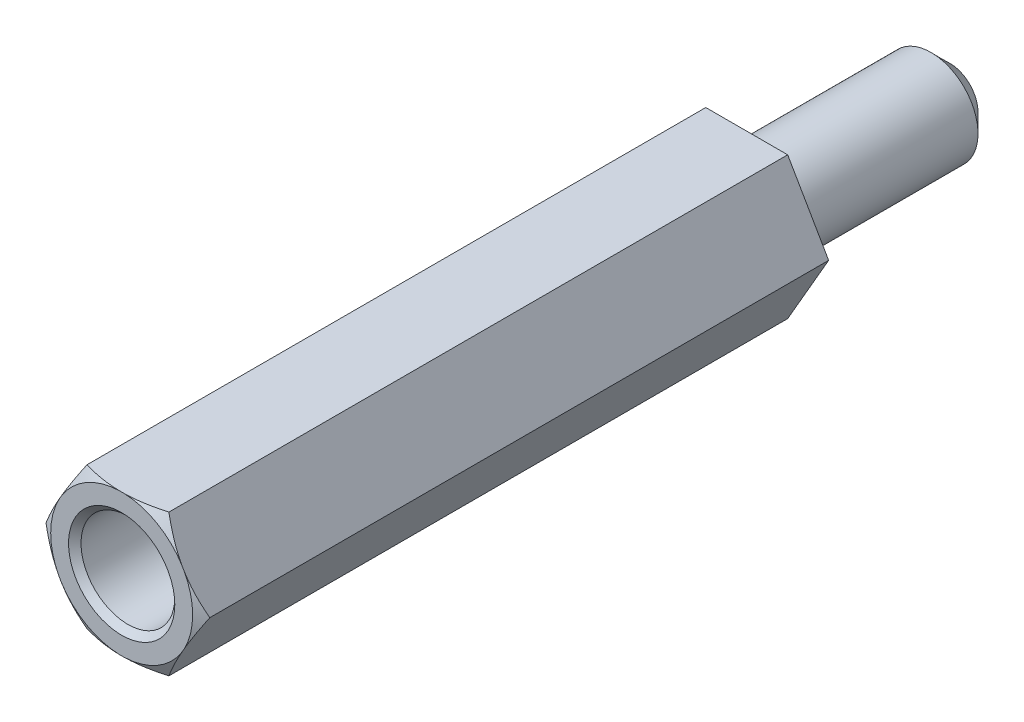
ISO-10303-21;
HEADER;
FILE_DESCRIPTION(('STEP AP214'),'2;1');
FILE_NAME('part.step','',(''),(''),'','','');
FILE_SCHEMA(('AUTOMOTIVE_DESIGN { 1 0 10303 214 1 1 1 1 }'));
ENDSEC;
DATA;
#1=APPLICATION_CONTEXT('core data for automotive mechanical design processes');
#2=APPLICATION_PROTOCOL_DEFINITION('international standard','automotive_design',2000,#1);
#3=PRODUCT_CONTEXT('',#1,'mechanical');
#4=PRODUCT('Part','Part','',(#3));
#5=PRODUCT_RELATED_PRODUCT_CATEGORY('part','',(#4));
#6=PRODUCT_DEFINITION_FORMATION('','',#4);
#7=PRODUCT_DEFINITION_CONTEXT('part definition',#1,'design');
#8=PRODUCT_DEFINITION('design','',#6,#7);
#9=PRODUCT_DEFINITION_SHAPE('','',#8);
#10=(LENGTH_UNIT() NAMED_UNIT(*) SI_UNIT(.MILLI.,.METRE.));
#11=(NAMED_UNIT(*) PLANE_ANGLE_UNIT() SI_UNIT($,.RADIAN.));
#12=(NAMED_UNIT(*) SI_UNIT($,.STERADIAN.) SOLID_ANGLE_UNIT());
#13=UNCERTAINTY_MEASURE_WITH_UNIT(LENGTH_MEASURE(1.E-05),#10,'distance_accuracy_value','');
#14=(GEOMETRIC_REPRESENTATION_CONTEXT(3) GLOBAL_UNCERTAINTY_ASSIGNED_CONTEXT((#13)) GLOBAL_UNIT_ASSIGNED_CONTEXT((#10,
#11,#12)) REPRESENTATION_CONTEXT('',''));
#15=CARTESIAN_POINT('',(0.,0.,0.));
#16=DIRECTION('',(0.,0.,1.));
#17=DIRECTION('',(1.,0.,0.));
#18=AXIS2_PLACEMENT_3D('',#15,#16,#17);
#19=CARTESIAN_POINT('',(0.,0.,20.));
#20=DIRECTION('',(0.,0.,1.));
#21=DIRECTION('',(1.,0.,0.));
#22=AXIS2_PLACEMENT_3D('',#19,#20,#21);
#23=PLANE('',#22);
#24=CARTESIAN_POINT('',(0.,0.,20.));
#25=DIRECTION('',(0.,0.,1.));
#26=DIRECTION('',(1.,0.,0.));
#27=AXIS2_PLACEMENT_3D('',#24,#25,#26);
#28=CIRCLE('',#27,1.7);
#29=CARTESIAN_POINT('',(1.7,0.,20.));
#30=VERTEX_POINT('',#29);
#31=EDGE_CURVE('E161',#30,#30,#28,.F.);
#32=ORIENTED_EDGE('',*,*,#31,.T.);
#33=EDGE_LOOP('',(#32));
#34=FACE_BOUND('',#33,.T.);
#35=CARTESIAN_POINT('',(0.,0.,20.));
#36=DIRECTION('',(0.,0.,1.));
#37=DIRECTION('',(1.,0.,0.));
#38=AXIS2_PLACEMENT_3D('',#35,#36,#37);
#39=CIRCLE('',#38,2.2711702221209);
#40=CARTESIAN_POINT('',(1.92942846272878,-1.19813187298426,20.));
#41=VERTEX_POINT('',#40);
#42=CARTESIAN_POINT('',(0.0728984077241233,-2.27,20.));
#43=VERTEX_POINT('',#42);
#44=EDGE_CURVE('E160',#41,#43,#39,.F.);
#45=ORIENTED_EDGE('',*,*,#44,.F.);
#46=DIRECTION('',(0.499999999999995,0.866025403784442,0.));
#47=VECTOR('',#46,1.);
#48=CARTESIAN_POINT('',(1.31058511106048,-2.26999999999999,20.));
#49=LINE('',#48,#47);
#50=CARTESIAN_POINT('',(2.0023268704526,-1.07186812701572,20.));
#51=VERTEX_POINT('',#50);
#52=EDGE_CURVE('E304',#41,#51,#49,.T.);
#53=ORIENTED_EDGE('',*,*,#52,.T.);
#54=CARTESIAN_POINT('',(2.00232687045273,1.07186812701549,20.));
#55=VERTEX_POINT('',#54);
#56=EDGE_CURVE('E157',#55,#51,#39,.F.);
#57=ORIENTED_EDGE('',*,*,#56,.F.);
#58=DIRECTION('',(-0.500000000000001,0.866025403784438,0.));
#59=VECTOR('',#58,1.);
#60=CARTESIAN_POINT('',(2.6211702221209,0.,20.));
#61=LINE('',#60,#59);
#62=CARTESIAN_POINT('',(1.92942846272862,1.19813187298452,20.));
#63=VERTEX_POINT('',#62);
#64=EDGE_CURVE('E316',#55,#63,#61,.T.);
#65=ORIENTED_EDGE('',*,*,#64,.T.);
#66=CARTESIAN_POINT('',(0.0728984077240917,2.27,20.));
#67=VERTEX_POINT('',#66);
#68=EDGE_CURVE('E159',#67,#63,#39,.F.);
#69=ORIENTED_EDGE('',*,*,#68,.F.);
#70=DIRECTION('',(-1.,0.,0.));
#71=VECTOR('',#70,1.);
#72=CARTESIAN_POINT('',(1.31058511106045,2.27,20.));
#73=LINE('',#72,#71);
#74=CARTESIAN_POINT('',(-0.0728984077241075,2.27,20.));
#75=VERTEX_POINT('',#74);
#76=EDGE_CURVE('E311',#67,#75,#73,.T.);
#77=ORIENTED_EDGE('',*,*,#76,.T.);
#78=CARTESIAN_POINT('',(-1.92942846272863,1.19813187298449,20.));
#79=VERTEX_POINT('',#78);
#80=EDGE_CURVE('E336',#79,#75,#39,.F.);
#81=ORIENTED_EDGE('',*,*,#80,.F.);
#82=DIRECTION('',(-0.499999999999995,-0.866025403784442,0.));
#83=VECTOR('',#82,1.);
#84=CARTESIAN_POINT('',(-1.31058511106046,2.27,20.));
#85=LINE('',#84,#83);
#86=CARTESIAN_POINT('',(-2.00232687045273,1.07186812701548,20.));
#87=VERTEX_POINT('',#86);
#88=EDGE_CURVE('E310',#79,#87,#85,.T.);
#89=ORIENTED_EDGE('',*,*,#88,.T.);
#90=CARTESIAN_POINT('',(-2.00232687045272,-1.0718681270155,20.));
#91=VERTEX_POINT('',#90);
#92=EDGE_CURVE('E121',#91,#87,#39,.F.);
#93=ORIENTED_EDGE('',*,*,#92,.F.);
#94=DIRECTION('',(0.500000000000007,-0.866025403784435,0.));
#95=VECTOR('',#94,1.);
#96=CARTESIAN_POINT('',(-2.6211702221209,0.,20.));
#97=LINE('',#96,#95);
#98=CARTESIAN_POINT('',(-1.92942846272861,-1.19813187298453,20.));
#99=VERTEX_POINT('',#98);
#100=EDGE_CURVE('E137',#91,#99,#97,.T.);
#101=ORIENTED_EDGE('',*,*,#100,.T.);
#102=CARTESIAN_POINT('',(-0.0728984077240759,-2.27,20.));
#103=VERTEX_POINT('',#102);
#104=EDGE_CURVE('E327',#103,#99,#39,.F.);
#105=ORIENTED_EDGE('',*,*,#104,.F.);
#106=DIRECTION('',(1.,0.,0.));
#107=VECTOR('',#106,1.);
#108=CARTESIAN_POINT('',(-1.31058511106043,-2.27000000000001,20.));
#109=LINE('',#108,#107);
#110=EDGE_CURVE('E296',#103,#43,#109,.T.);
#111=ORIENTED_EDGE('',*,*,#110,.T.);
#112=EDGE_LOOP('',(#45,#53,#57,#65,#69,#77,#81,#89,#93,#101,#105,#111));
#113=FACE_BOUND('',#112,.T.);
#114=ADVANCED_FACE('F32',(#34,#113),#23,.T.);
#115=CARTESIAN_POINT('',(1.31058511106048,-2.26999999999999,20.));
#116=DIRECTION('',(-0.866025403784442,0.499999999999995,0.));
#117=DIRECTION('',(-0.499999999999995,-0.866025403784442,0.));
#118=AXIS2_PLACEMENT_3D('',#115,#116,#117);
#119=PLANE('',#118);
#120=DIRECTION('',(0.,0.,-1.));
#121=VECTOR('',#120,1.);
#122=CARTESIAN_POINT('',(2.6211702221209,0.,20.));
#123=LINE('',#122,#121);
#124=CARTESIAN_POINT('',(2.6211702221209,0.,19.8));
#125=VERTEX_POINT('',#124);
#126=CARTESIAN_POINT('',(2.6211702221209,0.,0.));
#127=VERTEX_POINT('',#126);
#128=EDGE_CURVE('E155',#125,#127,#123,.T.);
#129=ORIENTED_EDGE('',*,*,#128,.F.);
#130=CARTESIAN_POINT('',(3.53192502802619,1.5774735970655,19.0874155357182));
#131=CARTESIAN_POINT('',(3.49038683177578,1.50552733070503,19.1258459368283));
#132=CARTESIAN_POINT('',(3.44875020540645,1.43341057837758,19.1638565423729));
#133=CARTESIAN_POINT('',(3.36523806633925,1.28876331046444,19.2388408708484));
#134=CARTESIAN_POINT('',(3.32336252393505,1.21623274342585,19.2758144613019));
#135=CARTESIAN_POINT('',(3.23920416390129,1.07046618796572,19.3486360571844));
#136=CARTESIAN_POINT('',(3.19692046373752,0.997228670950046,19.3844800017565));
#137=CARTESIAN_POINT('',(3.1120387281544,0.850209192285459,19.4546361454567));
#138=CARTESIAN_POINT('',(3.06944070287603,0.776427248201216,19.4889483937519));
#139=CARTESIAN_POINT('',(2.93902958582732,0.550548567601046,19.5907324723442));
#140=CARTESIAN_POINT('',(2.85063034563922,0.39743659224477,19.6552582519314));
#141=CARTESIAN_POINT('',(2.67192637782695,0.0879122404797577,19.7724545253547));
#142=CARTESIAN_POINT('',(2.58162393222902,-0.0684961833435812,19.8251384219436));
#143=CARTESIAN_POINT('',(2.42693241398782,-0.336429752437326,19.8992654299314));
#144=CARTESIAN_POINT('',(2.36310804900721,-0.446976795344554,19.9253337082215));
#145=CARTESIAN_POINT('',(2.23458545503779,-0.669584458020136,19.9666715963234));
#146=CARTESIAN_POINT('',(2.16988756118545,-0.781644497315092,19.9819452339838));
#147=CARTESIAN_POINT('',(2.04077595171336,-1.00527236476775,19.9998836306583));
#148=CARTESIAN_POINT('',(1.9763673113057,-1.11683140240025,20.0026891812466));
#149=CARTESIAN_POINT('',(1.84772217135016,-1.33965132095006,19.9957318097908));
#150=CARTESIAN_POINT('',(1.78348569252724,-1.45091216597068,19.9859674371621));
#151=CARTESIAN_POINT('',(1.63030365883242,-1.71623123113683,19.948841102754));
#152=CARTESIAN_POINT('',(1.54169424329172,-1.86970724088232,19.9160238630181));
#153=CARTESIAN_POINT('',(1.36642171508057,-2.17328816491509,19.8337386865889));
#154=CARTESIAN_POINT('',(1.27976131396272,-2.3233883826555,19.7842489190442));
#155=CARTESIAN_POINT('',(1.10733311832956,-2.62204277814955,19.6734296043506));
#156=CARTESIAN_POINT('',(1.02158612689542,-2.77056092390967,19.6119739052285));
#157=CARTESIAN_POINT('',(0.851622526986614,-3.06494651438903,19.4814839194208));
#158=CARTESIAN_POINT('',(0.767405153907192,-3.21081528344258,19.4124535477671));
#159=CARTESIAN_POINT('',(0.635892107966327,-3.4386025608703,19.2999058489881));
#160=CARTESIAN_POINT('',(0.588222071353258,-3.5211694862828,19.258115008667));
#161=CARTESIAN_POINT('',(0.493605207664278,-3.68505070144494,19.1735241810497));
#162=CARTESIAN_POINT('',(0.446655700740938,-3.76636963282647,19.1307361997354));
#163=CARTESIAN_POINT('',(0.399830305155195,-3.84747359706549,19.0874155357182));
#164=B_SPLINE_CURVE_WITH_KNOTS('',3,(#130,#131,#132,#133,#134,#135,#136,#137,#138,#139,#140,
#141,#142,#143,#144,#145,#146,#147,#148,#149,#150,#151,#152,#153,#154,#155,#156,#157,#158,#159,
#160,#161,#162,#163),.UNSPECIFIED.,.F.,.F.,(4,2,2,2,2,2,2,2,2,2,2,2,2,2,2,2,4),(0.,
0.274606048832124,0.549247019939774,0.82478302101827,1.10031017110168,1.66467514911567,
2.22839812072208,2.61888273310896,3.00922156533179,3.39514124414468,3.7811054625583,
4.32061090335247,4.86082553106862,5.40707820221011,5.9530498563352,6.26533246804885,
6.57488685439786),.UNSPECIFIED.);
#165=EDGE_CURVE('E294',#125,#51,#164,.T.);
#166=ORIENTED_EDGE('',*,*,#165,.T.);
#167=ORIENTED_EDGE('',*,*,#52,.F.);
#168=CARTESIAN_POINT('',(1.31058511106048,-2.26999999999999,19.8));
#169=VERTEX_POINT('',#168);
#170=EDGE_CURVE('E138',#41,#169,#164,.T.);
#171=ORIENTED_EDGE('',*,*,#170,.T.);
#172=DIRECTION('',(0.,0.,-1.));
#173=VECTOR('',#172,1.);
#174=CARTESIAN_POINT('',(1.31058511106048,-2.26999999999999,20.));
#175=LINE('',#174,#173);
#176=CARTESIAN_POINT('',(1.31058511106048,-2.26999999999999,0.));
#177=VERTEX_POINT('',#176);
#178=EDGE_CURVE('E150',#169,#177,#175,.T.);
#179=ORIENTED_EDGE('',*,*,#178,.T.);
#180=DIRECTION('',(0.499999999999995,0.866025403784442,0.));
#181=VECTOR('',#180,1.);
#182=CARTESIAN_POINT('',(1.31058511106048,-2.26999999999999,0.));
#183=LINE('',#182,#181);
#184=EDGE_CURVE('E282',#177,#127,#183,.T.);
#185=ORIENTED_EDGE('',*,*,#184,.T.);
#186=EDGE_LOOP('',(#129,#166,#167,#171,#179,#185));
#187=FACE_BOUND('',#186,.T.);
#188=ADVANCED_FACE('F243',(#187),#119,.F.);
#189=CARTESIAN_POINT('',(2.6211702221209,0.,20.));
#190=DIRECTION('',(-0.866025403784438,-0.500000000000001,0.));
#191=DIRECTION('',(0.500000000000001,-0.866025403784438,0.));
#192=AXIS2_PLACEMENT_3D('',#189,#190,#191);
#193=PLANE('',#192);
#194=DIRECTION('',(0.,0.,-1.));
#195=VECTOR('',#194,1.);
#196=CARTESIAN_POINT('',(1.31058511106045,2.27,20.));
#197=LINE('',#196,#195);
#198=CARTESIAN_POINT('',(1.31058511106045,2.27,19.8));
#199=VERTEX_POINT('',#198);
#200=CARTESIAN_POINT('',(1.31058511106045,2.27,0.));
#201=VERTEX_POINT('',#200);
#202=EDGE_CURVE('E148',#199,#201,#197,.T.);
#203=ORIENTED_EDGE('',*,*,#202,.F.);
#204=CARTESIAN_POINT('',(0.399830305155138,3.84747359706553,19.0874155357182));
#205=CARTESIAN_POINT('',(0.441368501405548,3.77552733070505,19.1258459368283));
#206=CARTESIAN_POINT('',(0.483005127774879,3.70341057837761,19.1638565423728));
#207=CARTESIAN_POINT('',(0.566517266842076,3.55876331046446,19.2388408708484));
#208=CARTESIAN_POINT('',(0.60839280924628,3.48623274342588,19.2758144613019));
#209=CARTESIAN_POINT('',(0.692551169280034,3.34046618796574,19.3486360571844));
#210=CARTESIAN_POINT('',(0.734834869443811,3.26722867095007,19.3844800017565));
#211=CARTESIAN_POINT('',(0.819716605026928,3.12020919228549,19.4546361454567));
#212=CARTESIAN_POINT('',(0.8623146303053,3.04642724820124,19.4889483937519));
#213=CARTESIAN_POINT('',(0.992725747354006,2.82054856760107,19.5907324723442));
#214=CARTESIAN_POINT('',(1.08112498754211,2.6674365922448,19.6552582519314));
#215=CARTESIAN_POINT('',(1.25982895535438,2.35791224047979,19.7724545253547));
#216=CARTESIAN_POINT('',(1.35013140095231,2.20150381665645,19.8251384219436));
#217=CARTESIAN_POINT('',(1.50482291919352,1.93357024756271,19.8992654299313));
#218=CARTESIAN_POINT('',(1.56864728417413,1.82302320465548,19.9253337082215));
#219=CARTESIAN_POINT('',(1.69716987814355,1.6004155419799,19.9666715963234));
#220=CARTESIAN_POINT('',(1.76186777199589,1.48835550268494,19.9819452339838));
#221=CARTESIAN_POINT('',(1.89097938146798,1.26472763523229,19.9998836306583));
#222=CARTESIAN_POINT('',(1.95538802187564,1.15316859759979,20.0026891812466));
#223=CARTESIAN_POINT('',(2.08403316183118,0.930348679049981,19.9957318097908));
#224=CARTESIAN_POINT('',(2.1482696406541,0.81908783402936,19.9859674371621));
#225=CARTESIAN_POINT('',(2.30145167434892,0.553768768863213,19.9488411027541));
#226=CARTESIAN_POINT('',(2.39006108988962,0.400292759117732,19.9160238630181));
#227=CARTESIAN_POINT('',(2.56533361810077,0.0967118350849743,19.8337386865889));
#228=CARTESIAN_POINT('',(2.65199401921862,-0.0533883826554375,19.7842489190442));
#229=CARTESIAN_POINT('',(2.82442221485177,-0.352042778149478,19.6734296043507));
#230=CARTESIAN_POINT('',(2.91016920628591,-0.500560923909593,19.6119739052285));
#231=CARTESIAN_POINT('',(3.08013280619471,-0.794946514388941,19.4814839194209));
#232=CARTESIAN_POINT('',(3.16435017927413,-0.940815283442479,19.4124535477672));
#233=CARTESIAN_POINT('',(3.29586322521501,-1.16860256087022,19.2999058489881));
#234=CARTESIAN_POINT('',(3.34353326182809,-1.25116948628275,19.258115008667));
#235=CARTESIAN_POINT('',(3.4381501255171,-1.41505070144493,19.1735241810497));
#236=CARTESIAN_POINT('',(3.48509963244045,-1.49636963282648,19.1307361997354));
#237=CARTESIAN_POINT('',(3.53192502802621,-1.57747359706552,19.0874155357182));
#238=B_SPLINE_CURVE_WITH_KNOTS('',3,(#204,#205,#206,#207,#208,#209,#210,#211,#212,#213,#214,
#215,#216,#217,#218,#219,#220,#221,#222,#223,#224,#225,#226,#227,#228,#229,#230,#231,#232,#233,
#234,#235,#236,#237),.UNSPECIFIED.,.F.,.F.,(4,2,2,2,2,2,2,2,2,2,2,2,2,2,2,2,4),(0.,
0.274606048832124,0.549247019939776,0.824783021018268,1.10031017110168,1.66467514911567,
2.22839812072209,2.61888273310896,3.00922156533179,3.39514124414468,3.7811054625583,
4.32061090335245,4.86082553106858,5.40707820221006,5.95304985633513,6.26533246804886,
6.57488685439796),.UNSPECIFIED.);
#239=EDGE_CURVE('E228',#199,#63,#238,.T.);
#240=ORIENTED_EDGE('',*,*,#239,.T.);
#241=ORIENTED_EDGE('',*,*,#64,.F.);
#242=EDGE_CURVE('E325',#55,#125,#238,.T.);
#243=ORIENTED_EDGE('',*,*,#242,.T.);
#244=ORIENTED_EDGE('',*,*,#128,.T.);
#245=DIRECTION('',(-0.500000000000001,0.866025403784438,0.));
#246=VECTOR('',#245,1.);
#247=CARTESIAN_POINT('',(2.6211702221209,0.,0.));
#248=LINE('',#247,#246);
#249=EDGE_CURVE('E287',#127,#201,#248,.T.);
#250=ORIENTED_EDGE('',*,*,#249,.T.);
#251=EDGE_LOOP('',(#203,#240,#241,#243,#244,#250));
#252=FACE_BOUND('',#251,.T.);
#253=ADVANCED_FACE('F238',(#252),#193,.F.);
#254=CARTESIAN_POINT('',(1.31058511106045,2.27,20.));
#255=DIRECTION('',(0.,-1.,0.));
#256=DIRECTION('',(1.,0.,0.));
#257=AXIS2_PLACEMENT_3D('',#254,#255,#256);
#258=PLANE('',#257);
#259=DIRECTION('',(0.,0.,-1.));
#260=VECTOR('',#259,1.);
#261=CARTESIAN_POINT('',(-1.31058511106046,2.27,20.));
#262=LINE('',#261,#260);
#263=CARTESIAN_POINT('',(-1.31058511106046,2.27,19.8));
#264=VERTEX_POINT('',#263);
#265=CARTESIAN_POINT('',(-1.31058511106046,2.27,0.));
#266=VERTEX_POINT('',#265);
#267=EDGE_CURVE('E145',#264,#266,#262,.T.);
#268=ORIENTED_EDGE('',*,*,#267,.F.);
#269=CARTESIAN_POINT('',(-2.88805870812598,2.26999999999999,19.1987324103344));
#270=CARTESIAN_POINT('',(-2.80547290408561,2.26999999999999,19.2358255324642));
#271=CARTESIAN_POINT('',(-2.72266390787582,2.26999999999999,19.2724300278098));
#272=CARTESIAN_POINT('',(-2.5565026612848,2.26999999999999,19.3444249566602));
#273=CARTESIAN_POINT('',(-2.47315031505662,2.26999999999999,19.3798151686687));
#274=CARTESIAN_POINT('',(-2.30548338672952,2.26999999999999,19.4492769222981));
#275=CARTESIAN_POINT('',(-2.22116623150815,2.26999999999999,19.4833422884396));
#276=CARTESIAN_POINT('',(-2.05182779905438,2.26999999999999,19.5496595457378));
#277=CARTESIAN_POINT('',(-1.96680655448941,2.26999999999999,19.5819115204949));
#278=CARTESIAN_POINT('',(-1.71138311857312,2.26999999999999,19.6750656041859));
#279=CARTESIAN_POINT('',(-1.53976972748372,2.26999999999999,19.7327268658694));
#280=CARTESIAN_POINT('',(-1.19280228070996,2.27,19.8349421604165));
#281=CARTESIAN_POINT('',(-1.0174542453261,2.27,19.879515794802));
#282=CARTESIAN_POINT('',(-0.712090771389066,2.27,19.9400719954737));
#283=CARTESIAN_POINT('',(-0.582987722953598,2.27,19.9605553386303));
#284=CARTESIAN_POINT('',(-0.323439084569022,2.27,19.989581233522));
#285=CARTESIAN_POINT('',(-0.192993977067311,2.27,19.9981279349084));
#286=CARTESIAN_POINT('',(0.0680599454394179,2.27,20.0022273630874));
#287=CARTESIAN_POINT('',(0.198668678458226,2.27,19.9977850727737));
#288=CARTESIAN_POINT('',(0.458851198221977,2.27,19.976485692699));
#289=CARTESIAN_POINT('',(0.58842474295573,2.27,19.9596257810572));
#290=CARTESIAN_POINT('',(0.904937752962769,2.27,19.9051607953018));
#291=CARTESIAN_POINT('',(1.09083477493526,2.27,19.8615794043185));
#292=CARTESIAN_POINT('',(1.36639728986913,2.27,19.7844964765957));
#293=CARTESIAN_POINT('',(1.457811536611,2.27,19.7568102536344));
#294=CARTESIAN_POINT('',(1.63961899594484,2.27000000000001,19.6982591090532));
#295=CARTESIAN_POINT('',(1.73001229033947,2.27000000000001,19.6673944441364));
#296=CARTESIAN_POINT('',(1.91077257487063,2.27000000000001,19.6027837141474));
#297=CARTESIAN_POINT('',(2.00113026057099,2.27000000000001,19.5690119189924));
#298=CARTESIAN_POINT('',(2.18103313876789,2.27000000000001,19.499360278944));
#299=CARTESIAN_POINT('',(2.27057828364605,2.27000000000001,19.4634803114121));
#300=CARTESIAN_POINT('',(2.44846011178726,2.27000000000001,19.3902269588395));
#301=CARTESIAN_POINT('',(2.53680076536779,2.27000000000001,19.352863166806));
#302=CARTESIAN_POINT('',(2.71286376090329,2.27000000000001,19.2767584059864));
#303=CARTESIAN_POINT('',(2.80058623966965,2.27000000000001,19.2380177541729));
#304=CARTESIAN_POINT('',(2.88805870812597,2.27000000000001,19.1987324103344));
#305=B_SPLINE_CURVE_WITH_KNOTS('',3,(#269,#270,#271,#272,#273,#274,#275,#276,#277,#278,#279,
#280,#281,#282,#283,#284,#285,#286,#287,#288,#289,#290,#291,#292,#293,#294,#295,#296,#297,#298,
#299,#300,#301,#302,#303,#304),.UNSPECIFIED.,.F.,.F.,(4,2,2,2,2,2,2,2,2,2,2,2,2,2,2,2,2,4),(0.,
0.271603728461578,0.543256739373978,0.816052841064966,1.08883635605,1.63163153509611,
2.17360956621754,2.56530041766832,2.95685506788363,3.34825952790367,3.73975296129823,
4.31141566486306,4.59793246001131,4.88442613310071,5.17378506531959,5.46316084709717,
5.75090015934329,6.03857365362723),.UNSPECIFIED.);
#306=EDGE_CURVE('E220',#264,#75,#305,.T.);
#307=ORIENTED_EDGE('',*,*,#306,.T.);
#308=ORIENTED_EDGE('',*,*,#76,.F.);
#309=EDGE_CURVE('E227',#67,#199,#305,.T.);
#310=ORIENTED_EDGE('',*,*,#309,.T.);
#311=ORIENTED_EDGE('',*,*,#202,.T.);
#312=DIRECTION('',(-1.,0.,0.));
#313=VECTOR('',#312,1.);
#314=CARTESIAN_POINT('',(1.31058511106045,2.27,0.));
#315=LINE('',#314,#313);
#316=EDGE_CURVE('E291',#201,#266,#315,.T.);
#317=ORIENTED_EDGE('',*,*,#316,.T.);
#318=EDGE_LOOP('',(#268,#307,#308,#310,#311,#317));
#319=FACE_BOUND('',#318,.T.);
#320=ADVANCED_FACE('F235',(#319),#258,.F.);
#321=CARTESIAN_POINT('',(-1.31058511106046,2.27,20.));
#322=DIRECTION('',(0.866025403784442,-0.499999999999995,0.));
#323=DIRECTION('',(0.499999999999995,0.866025403784442,0.));
#324=AXIS2_PLACEMENT_3D('',#321,#322,#323);
#325=PLANE('',#324);
#326=DIRECTION('',(0.,0.,-1.));
#327=VECTOR('',#326,1.);
#328=CARTESIAN_POINT('',(-2.6211702221209,0.,20.));
#329=LINE('',#328,#327);
#330=CARTESIAN_POINT('',(-2.6211702221209,0.,19.8));
#331=VERTEX_POINT('',#330);
#332=CARTESIAN_POINT('',(-2.6211702221209,0.,0.));
#333=VERTEX_POINT('',#332);
#334=EDGE_CURVE('E133',#331,#333,#329,.T.);
#335=ORIENTED_EDGE('',*,*,#334,.F.);
#336=CARTESIAN_POINT('',(-3.5319250280262,-1.57747359706554,19.0874155357182));
#337=CARTESIAN_POINT('',(-3.49038683177579,-1.50552733070506,19.1258459368283));
#338=CARTESIAN_POINT('',(-3.44875020540646,-1.43341057837762,19.1638565423728));
#339=CARTESIAN_POINT('',(-3.36523806633926,-1.28876331046448,19.2388408708484));
#340=CARTESIAN_POINT('',(-3.32336252393506,-1.21623274342589,19.2758144613019));
#341=CARTESIAN_POINT('',(-3.2392041639013,-1.07046618796575,19.3486360571844));
#342=CARTESIAN_POINT('',(-3.19692046373753,-0.997228670950083,19.3844800017565));
#343=CARTESIAN_POINT('',(-3.11203872815441,-0.850209192285496,19.4546361454567));
#344=CARTESIAN_POINT('',(-3.06944070287604,-0.776427248201252,19.4889483937519));
#345=CARTESIAN_POINT('',(-2.93902958582734,-0.550548567601082,19.5907324723442));
#346=CARTESIAN_POINT('',(-2.85063034563924,-0.397436592244806,19.6552582519314));
#347=CARTESIAN_POINT('',(-2.67192637782696,-0.0879122404797936,19.7724545253547));
#348=CARTESIAN_POINT('',(-2.58162393222904,0.068496183343545,19.8251384219436));
#349=CARTESIAN_POINT('',(-2.42693241398783,0.336429752437289,19.8992654299313));
#350=CARTESIAN_POINT('',(-2.36310804900722,0.446976795344516,19.9253337082215));
#351=CARTESIAN_POINT('',(-2.2345854550378,0.669584458020097,19.9666715963234));
#352=CARTESIAN_POINT('',(-2.16988756118546,0.781644497315053,19.9819452339838));
#353=CARTESIAN_POINT('',(-2.04077595171337,1.00527236476771,19.9998836306583));
#354=CARTESIAN_POINT('',(-1.97636731130571,1.11683140240021,20.0026891812466));
#355=CARTESIAN_POINT('',(-1.84772217135017,1.33965132095002,19.9957318097908));
#356=CARTESIAN_POINT('',(-1.78348569252725,1.45091216597064,19.9859674371621));
#357=CARTESIAN_POINT('',(-1.63030365883244,1.71623123113679,19.948841102754));
#358=CARTESIAN_POINT('',(-1.54169424329174,1.86970724088227,19.9160238630181));
#359=CARTESIAN_POINT('',(-1.36642171508059,2.17328816491503,19.8337386865889));
#360=CARTESIAN_POINT('',(-1.27976131396274,2.32338838265544,19.7842489190442));
#361=CARTESIAN_POINT('',(-1.10733311832959,2.62204277814949,19.6734296043507));
#362=CARTESIAN_POINT('',(-1.02158612689545,2.7705609239096,19.6119739052285));
#363=CARTESIAN_POINT('',(-0.851622526986649,3.06494651438895,19.4814839194208));
#364=CARTESIAN_POINT('',(-0.76740515390723,3.21081528344249,19.4124535477672));
#365=CARTESIAN_POINT('',(-0.635892107966356,3.43860256087023,19.2999058489881));
#366=CARTESIAN_POINT('',(-0.588222071353275,3.52116948628275,19.258115008667));
#367=CARTESIAN_POINT('',(-0.493605207664273,3.68505070144493,19.1735241810497));
#368=CARTESIAN_POINT('',(-0.446655700740922,3.76636963282648,19.1307361997354));
#369=CARTESIAN_POINT('',(-0.399830305155168,3.84747359706552,19.0874155357182));
#370=B_SPLINE_CURVE_WITH_KNOTS('',3,(#336,#337,#338,#339,#340,#341,#342,#343,#344,#345,#346,
#347,#348,#349,#350,#351,#352,#353,#354,#355,#356,#357,#358,#359,#360,#361,#362,#363,#364,#365,
#366,#367,#368,#369),.UNSPECIFIED.,.F.,.F.,(4,2,2,2,2,2,2,2,2,2,2,2,2,2,2,2,4),(0.,
0.274606048832125,0.549247019939774,0.82478302101827,1.10031017110168,1.66467514911567,
2.22839812072209,2.61888273310896,3.00922156533179,3.39514124414468,3.7811054625583,
4.32061090335245,4.86082553106859,5.40707820221007,5.95304985633514,6.26533246804886,
6.57488685439794),.UNSPECIFIED.);
#371=EDGE_CURVE('E119',#331,#87,#370,.T.);
#372=ORIENTED_EDGE('',*,*,#371,.T.);
#373=ORIENTED_EDGE('',*,*,#88,.F.);
#374=EDGE_CURVE('E126',#79,#264,#370,.T.);
#375=ORIENTED_EDGE('',*,*,#374,.T.);
#376=ORIENTED_EDGE('',*,*,#267,.T.);
#377=DIRECTION('',(-0.499999999999995,-0.866025403784442,0.));
#378=VECTOR('',#377,1.);
#379=CARTESIAN_POINT('',(-1.31058511106046,2.27,0.));
#380=LINE('',#379,#378);
#381=EDGE_CURVE('E143',#266,#333,#380,.T.);
#382=ORIENTED_EDGE('',*,*,#381,.T.);
#383=EDGE_LOOP('',(#335,#372,#373,#375,#376,#382));
#384=FACE_BOUND('',#383,.T.);
#385=ADVANCED_FACE('F141',(#384),#325,.F.);
#386=CARTESIAN_POINT('',(-2.6211702221209,0.,20.));
#387=DIRECTION('',(0.866025403784435,0.500000000000007,0.));
#388=DIRECTION('',(-0.500000000000007,0.866025403784435,0.));
#389=AXIS2_PLACEMENT_3D('',#386,#387,#388);
#390=PLANE('',#389);
#391=DIRECTION('',(0.,0.,-1.));
#392=VECTOR('',#391,1.);
#393=CARTESIAN_POINT('',(-1.31058511106043,-2.27000000000001,20.));
#394=LINE('',#393,#392);
#395=CARTESIAN_POINT('',(-1.31058511106043,-2.27000000000001,19.8));
#396=VERTEX_POINT('',#395);
#397=CARTESIAN_POINT('',(-1.31058511106043,-2.27000000000001,0.));
#398=VERTEX_POINT('',#397);
#399=EDGE_CURVE('E146',#396,#398,#394,.T.);
#400=ORIENTED_EDGE('',*,*,#399,.F.);
#401=CARTESIAN_POINT('',(-0.399830305155107,-3.84747359706554,19.0874155357182));
#402=CARTESIAN_POINT('',(-0.441368501405518,-3.77552733070506,19.1258459368283));
#403=CARTESIAN_POINT('',(-0.48300512777485,-3.70341057837762,19.1638565423728));
#404=CARTESIAN_POINT('',(-0.566517266842048,-3.55876331046447,19.2388408708484));
#405=CARTESIAN_POINT('',(-0.608392809246252,-3.48623274342589,19.2758144613019));
#406=CARTESIAN_POINT('',(-0.692551169280007,-3.34046618796575,19.3486360571844));
#407=CARTESIAN_POINT('',(-0.734834869443784,-3.26722867095008,19.3844800017565));
#408=CARTESIAN_POINT('',(-0.819716605026902,-3.1202091922855,19.4546361454567));
#409=CARTESIAN_POINT('',(-0.862314630305275,-3.04642724820126,19.4889483937519));
#410=CARTESIAN_POINT('',(-0.992725747353983,-2.82054856760109,19.5907324723442));
#411=CARTESIAN_POINT('',(-1.08112498754208,-2.66743659224481,19.6552582519314));
#412=CARTESIAN_POINT('',(-1.25982895535436,-2.3579122404798,19.7724545253547));
#413=CARTESIAN_POINT('',(-1.35013140095229,-2.20150381665646,19.8251384219436));
#414=CARTESIAN_POINT('',(-1.5048229191935,-1.93357024756272,19.8992654299313));
#415=CARTESIAN_POINT('',(-1.56864728417411,-1.8230232046555,19.9253337082215));
#416=CARTESIAN_POINT('',(-1.69716987814353,-1.60041554197992,19.9666715963234));
#417=CARTESIAN_POINT('',(-1.76186777199587,-1.48835550268496,19.9819452339838));
#418=CARTESIAN_POINT('',(-1.89097938146797,-1.26472763523231,19.9998836306583));
#419=CARTESIAN_POINT('',(-1.95538802187563,-1.15316859759981,20.0026891812466));
#420=CARTESIAN_POINT('',(-2.08403316183117,-0.930348679050002,19.9957318097908));
#421=CARTESIAN_POINT('',(-2.14826964065409,-0.819087834029382,19.9859674371621));
#422=CARTESIAN_POINT('',(-2.30145167434891,-0.553768768863238,19.9488411027541));
#423=CARTESIAN_POINT('',(-2.39006108988961,-0.400292759117759,19.9160238630181));
#424=CARTESIAN_POINT('',(-2.56533361810076,-0.0967118350850035,19.8337386865889));
#425=CARTESIAN_POINT('',(-2.65199401921861,0.0533883826554073,19.7842489190442));
#426=CARTESIAN_POINT('',(-2.82442221485176,0.352042778149445,19.6734296043507));
#427=CARTESIAN_POINT('',(-2.91016920628591,0.50056092390956,19.6119739052285));
#428=CARTESIAN_POINT('',(-3.08013280619471,0.794946514388906,19.4814839194209));
#429=CARTESIAN_POINT('',(-3.16435017927413,0.940815283442443,19.4124535477672));
#430=CARTESIAN_POINT('',(-3.29586322521501,1.16860256087018,19.2999058489881));
#431=CARTESIAN_POINT('',(-3.3435332618281,1.25116948628272,19.258115008667));
#432=CARTESIAN_POINT('',(-3.43815012551711,1.4150507014449,19.1735241810497));
#433=CARTESIAN_POINT('',(-3.48509963244047,1.49636963282646,19.1307361997354));
#434=CARTESIAN_POINT('',(-3.53192502802623,1.5774735970655,19.0874155357182));
#435=B_SPLINE_CURVE_WITH_KNOTS('',3,(#401,#402,#403,#404,#405,#406,#407,#408,#409,#410,#411,
#412,#413,#414,#415,#416,#417,#418,#419,#420,#421,#422,#423,#424,#425,#426,#427,#428,#429,#430,
#431,#432,#433,#434),.UNSPECIFIED.,.F.,.F.,(4,2,2,2,2,2,2,2,2,2,2,2,2,2,2,2,4),(0.,
0.274606048832125,0.549247019939775,0.82478302101827,1.10031017110168,1.66467514911567,
2.22839812072209,2.61888273310896,3.00922156533179,3.39514124414468,3.7811054625583,
4.32061090335245,4.86082553106858,5.40707820221005,5.95304985633512,6.26533246804887,
6.57488685439798),.UNSPECIFIED.);
#436=EDGE_CURVE('E140',#396,#99,#435,.T.);
#437=ORIENTED_EDGE('',*,*,#436,.T.);
#438=ORIENTED_EDGE('',*,*,#100,.F.);
#439=EDGE_CURVE('E55',#91,#331,#435,.T.);
#440=ORIENTED_EDGE('',*,*,#439,.T.);
#441=ORIENTED_EDGE('',*,*,#334,.T.);
#442=DIRECTION('',(0.500000000000007,-0.866025403784435,0.));
#443=VECTOR('',#442,1.);
#444=CARTESIAN_POINT('',(-2.6211702221209,0.,0.));
#445=LINE('',#444,#443);
#446=EDGE_CURVE('E302',#333,#398,#445,.T.);
#447=ORIENTED_EDGE('',*,*,#446,.T.);
#448=EDGE_LOOP('',(#400,#437,#438,#440,#441,#447));
#449=FACE_BOUND('',#448,.T.);
#450=ADVANCED_FACE('F131',(#449),#390,.F.);
#451=CARTESIAN_POINT('',(-1.31058511106043,-2.27000000000001,20.));
#452=DIRECTION('',(0.,1.,0.));
#453=DIRECTION('',(-1.,0.,0.));
#454=AXIS2_PLACEMENT_3D('',#451,#452,#453);
#455=PLANE('',#454);
#456=ORIENTED_EDGE('',*,*,#178,.F.);
#457=CARTESIAN_POINT('',(2.888058708126,-2.26999999999997,19.1987324103344));
#458=CARTESIAN_POINT('',(2.80547290408563,-2.26999999999997,19.2358255324642));
#459=CARTESIAN_POINT('',(2.72266390787583,-2.26999999999997,19.2724300278098));
#460=CARTESIAN_POINT('',(2.55650266128482,-2.26999999999997,19.3444249566602));
#461=CARTESIAN_POINT('',(2.47315031505663,-2.26999999999997,19.3798151686687));
#462=CARTESIAN_POINT('',(2.30548338672953,-2.26999999999998,19.4492769222981));
#463=CARTESIAN_POINT('',(2.22116623150816,-2.26999999999998,19.4833422884396));
#464=CARTESIAN_POINT('',(2.0518277990544,-2.26999999999998,19.5496595457378));
#465=CARTESIAN_POINT('',(1.96680655448942,-2.26999999999998,19.5819115204949));
#466=CARTESIAN_POINT('',(1.71138311857313,-2.26999999999998,19.6750656041859));
#467=CARTESIAN_POINT('',(1.53976972748373,-2.26999999999998,19.7327268658694));
#468=CARTESIAN_POINT('',(1.19280228070998,-2.26999999999999,19.8349421604165));
#469=CARTESIAN_POINT('',(1.01745424532611,-2.26999999999999,19.879515794802));
#470=CARTESIAN_POINT('',(0.71209077138908,-2.26999999999999,19.9400719954737));
#471=CARTESIAN_POINT('',(0.582987722953612,-2.26999999999999,19.9605553386303));
#472=CARTESIAN_POINT('',(0.323439084569036,-2.27,19.989581233522));
#473=CARTESIAN_POINT('',(0.192993977067324,-2.27,19.9981279349084));
#474=CARTESIAN_POINT('',(-0.0680599454394051,-2.27,20.0022273630874));
#475=CARTESIAN_POINT('',(-0.198668678458213,-2.27,19.9977850727737));
#476=CARTESIAN_POINT('',(-0.458851198221964,-2.27,19.976485692699));
#477=CARTESIAN_POINT('',(-0.588424742955717,-2.27000000000001,19.9596257810572));
#478=CARTESIAN_POINT('',(-0.904937752962757,-2.27000000000001,19.9051607953018));
#479=CARTESIAN_POINT('',(-1.09083477493525,-2.27000000000001,19.8615794043185));
#480=CARTESIAN_POINT('',(-1.36639728986912,-2.27000000000001,19.7844964765957));
#481=CARTESIAN_POINT('',(-1.45781153661099,-2.27000000000002,19.7568102536344));
#482=CARTESIAN_POINT('',(-1.63961899594482,-2.27000000000002,19.6982591090532));
#483=CARTESIAN_POINT('',(-1.73001229033945,-2.27000000000002,19.6673944441364));
#484=CARTESIAN_POINT('',(-1.91077257487061,-2.27000000000002,19.6027837141474));
#485=CARTESIAN_POINT('',(-2.00113026057097,-2.27000000000002,19.5690119189924));
#486=CARTESIAN_POINT('',(-2.18103313876788,-2.27000000000002,19.499360278944));
#487=CARTESIAN_POINT('',(-2.27057828364603,-2.27000000000002,19.4634803114121));
#488=CARTESIAN_POINT('',(-2.44846011178725,-2.27000000000003,19.3902269588395));
#489=CARTESIAN_POINT('',(-2.53680076536777,-2.27000000000003,19.352863166806));
#490=CARTESIAN_POINT('',(-2.71286376090327,-2.27000000000003,19.2767584059864));
#491=CARTESIAN_POINT('',(-2.80058623966963,-2.27000000000003,19.2380177541729));
#492=CARTESIAN_POINT('',(-2.88805870812595,-2.27000000000003,19.1987324103344));
#493=B_SPLINE_CURVE_WITH_KNOTS('',3,(#457,#458,#459,#460,#461,#462,#463,#464,#465,#466,#467,
#468,#469,#470,#471,#472,#473,#474,#475,#476,#477,#478,#479,#480,#481,#482,#483,#484,#485,#486,
#487,#488,#489,#490,#491,#492),.UNSPECIFIED.,.F.,.F.,(4,2,2,2,2,2,2,2,2,2,2,2,2,2,2,2,2,4),(0.,
0.271603728461578,0.543256739373977,0.816052841064966,1.08883635605,1.63163153509611,
2.17360956621754,2.56530041766833,2.95685506788363,3.34825952790367,3.73975296129823,
4.31141566486306,4.59793246001131,4.88442613310071,5.17378506531959,5.46316084709717,
5.75090015934329,6.03857365362723),.UNSPECIFIED.);
#494=EDGE_CURVE('E181',#169,#43,#493,.T.);
#495=ORIENTED_EDGE('',*,*,#494,.T.);
#496=ORIENTED_EDGE('',*,*,#110,.F.);
#497=EDGE_CURVE('E47',#103,#396,#493,.T.);
#498=ORIENTED_EDGE('',*,*,#497,.T.);
#499=ORIENTED_EDGE('',*,*,#399,.T.);
#500=DIRECTION('',(1.,0.,0.));
#501=VECTOR('',#500,1.);
#502=CARTESIAN_POINT('',(-1.31058511106043,-2.27000000000001,0.));
#503=LINE('',#502,#501);
#504=EDGE_CURVE('E284',#398,#177,#503,.T.);
#505=ORIENTED_EDGE('',*,*,#504,.T.);
#506=EDGE_LOOP('',(#456,#495,#496,#498,#499,#505));
#507=FACE_BOUND('',#506,.T.);
#508=ADVANCED_FACE('F188',(#507),#455,.F.);
#509=CARTESIAN_POINT('',(0.,0.,0.));
#510=DIRECTION('',(0.,0.,1.));
#511=DIRECTION('',(1.,0.,0.));
#512=AXIS2_PLACEMENT_3D('',#509,#510,#511);
#513=PLANE('',#512);
#514=CARTESIAN_POINT('',(0.,0.,0.));
#515=DIRECTION('',(0.,0.,-1.));
#516=DIRECTION('',(-1.,0.,0.));
#517=AXIS2_PLACEMENT_3D('',#514,#515,#516);
#518=CIRCLE('',#517,1.5);
#519=CARTESIAN_POINT('',(-1.5,0.,0.));
#520=VERTEX_POINT('',#519);
#521=EDGE_CURVE('E166',#520,#520,#518,.T.);
#522=ORIENTED_EDGE('',*,*,#521,.F.);
#523=EDGE_LOOP('',(#522));
#524=FACE_BOUND('',#523,.T.);
#525=ORIENTED_EDGE('',*,*,#184,.F.);
#526=ORIENTED_EDGE('',*,*,#504,.F.);
#527=ORIENTED_EDGE('',*,*,#446,.F.);
#528=ORIENTED_EDGE('',*,*,#381,.F.);
#529=ORIENTED_EDGE('',*,*,#316,.F.);
#530=ORIENTED_EDGE('',*,*,#249,.F.);
#531=EDGE_LOOP('',(#525,#526,#527,#528,#529,#530));
#532=FACE_BOUND('',#531,.T.);
#533=ADVANCED_FACE('F268',(#524,#532),#513,.F.);
#534=CARTESIAN_POINT('',(0.,0.,20.000012));
#535=DIRECTION('',(0.,0.,-1.));
#536=DIRECTION('',(-1.,0.,0.));
#537=AXIS2_PLACEMENT_3D('',#534,#535,#536);
#538=CYLINDRICAL_SURFACE('',#537,1.5);
#539=CARTESIAN_POINT('',(0.,0.,19.8));
#540=DIRECTION('',(0.,0.,1.));
#541=DIRECTION('',(1.,0.,0.));
#542=AXIS2_PLACEMENT_3D('',#539,#540,#541);
#543=CIRCLE('',#542,1.5);
#544=CARTESIAN_POINT('',(1.5,0.,19.8));
#545=VERTEX_POINT('',#544);
#546=EDGE_CURVE('E164',#545,#545,#543,.T.);
#547=ORIENTED_EDGE('',*,*,#546,.T.);
#548=EDGE_LOOP('',(#547));
#549=FACE_BOUND('',#548,.T.);
#550=CARTESIAN_POINT('',(0.,0.,8.));
#551=DIRECTION('',(0.,0.,1.));
#552=DIRECTION('',(1.,0.,0.));
#553=AXIS2_PLACEMENT_3D('',#550,#551,#552);
#554=CIRCLE('',#553,1.5);
#555=CARTESIAN_POINT('',(1.5,0.,8.));
#556=VERTEX_POINT('',#555);
#557=EDGE_CURVE('E289',#556,#556,#554,.T.);
#558=ORIENTED_EDGE('',*,*,#557,.F.);
#559=EDGE_LOOP('',(#558));
#560=FACE_BOUND('',#559,.T.);
#561=ADVANCED_FACE('F267',(#549,#560),#538,.F.);
#562=CARTESIAN_POINT('',(0.,0.,8.));
#563=DIRECTION('',(0.,0.,1.));
#564=DIRECTION('',(1.,0.,0.));
#565=AXIS2_PLACEMENT_3D('',#562,#563,#564);
#566=PLANE('',#565);
#567=ORIENTED_EDGE('',*,*,#557,.T.);
#568=EDGE_LOOP('',(#567));
#569=FACE_BOUND('',#568,.T.);
#570=ADVANCED_FACE('F197',(#569),#566,.T.);
#571=CARTESIAN_POINT('',(0.,0.,20.));
#572=DIRECTION('',(0.,0.,-1.));
#573=DIRECTION('',(-1.,0.,0.));
#574=AXIS2_PLACEMENT_3D('',#571,#572,#573);
#575=CONICAL_SURFACE('',#574,2.2711702221209,1.05165021254838);
#576=ORIENTED_EDGE('',*,*,#242,.F.);
#577=ORIENTED_EDGE('',*,*,#56,.T.);
#578=ORIENTED_EDGE('',*,*,#165,.F.);
#579=EDGE_LOOP('',(#576,#577,#578));
#580=FACE_BOUND('',#579,.T.);
#581=ADVANCED_FACE('F191',(#580),#575,.T.);
#582=ORIENTED_EDGE('',*,*,#309,.F.);
#583=ORIENTED_EDGE('',*,*,#68,.T.);
#584=ORIENTED_EDGE('',*,*,#239,.F.);
#585=EDGE_LOOP('',(#582,#583,#584));
#586=FACE_BOUND('',#585,.T.);
#587=ADVANCED_FACE('F196',(#586),#575,.T.);
#588=ORIENTED_EDGE('',*,*,#374,.F.);
#589=ORIENTED_EDGE('',*,*,#80,.T.);
#590=ORIENTED_EDGE('',*,*,#306,.F.);
#591=EDGE_LOOP('',(#588,#589,#590));
#592=FACE_BOUND('',#591,.T.);
#593=ADVANCED_FACE('F339',(#592),#575,.T.);
#594=ORIENTED_EDGE('',*,*,#439,.F.);
#595=ORIENTED_EDGE('',*,*,#92,.T.);
#596=ORIENTED_EDGE('',*,*,#371,.F.);
#597=EDGE_LOOP('',(#594,#595,#596));
#598=FACE_BOUND('',#597,.T.);
#599=ADVANCED_FACE('F120',(#598),#575,.T.);
#600=ORIENTED_EDGE('',*,*,#497,.F.);
#601=ORIENTED_EDGE('',*,*,#104,.T.);
#602=ORIENTED_EDGE('',*,*,#436,.F.);
#603=EDGE_LOOP('',(#600,#601,#602));
#604=FACE_BOUND('',#603,.T.);
#605=ADVANCED_FACE('F199',(#604),#575,.T.);
#606=ORIENTED_EDGE('',*,*,#44,.T.);
#607=ORIENTED_EDGE('',*,*,#494,.F.);
#608=ORIENTED_EDGE('',*,*,#170,.F.);
#609=EDGE_LOOP('',(#606,#607,#608));
#610=FACE_BOUND('',#609,.T.);
#611=ADVANCED_FACE('F250',(#610),#575,.T.);
#612=CARTESIAN_POINT('',(0.,0.,20.));
#613=DIRECTION('',(0.,0.,1.));
#614=DIRECTION('',(1.,0.,0.));
#615=AXIS2_PLACEMENT_3D('',#612,#613,#614);
#616=CONICAL_SURFACE('',#615,1.7,0.785398163397446);
#617=ORIENTED_EDGE('',*,*,#546,.F.);
#618=EDGE_LOOP('',(#617));
#619=FACE_BOUND('',#618,.T.);
#620=ORIENTED_EDGE('',*,*,#31,.F.);
#621=EDGE_LOOP('',(#620));
#622=FACE_BOUND('',#621,.T.);
#623=ADVANCED_FACE('F248',(#619,#622),#616,.F.);
#624=CARTESIAN_POINT('',(0.,0.,-6.5));
#625=DIRECTION('',(0.,0.,1.));
#626=DIRECTION('',(1.,0.,0.));
#627=AXIS2_PLACEMENT_3D('',#624,#625,#626);
#628=CYLINDRICAL_SURFACE('',#627,1.5);
#629=CARTESIAN_POINT('',(0.,0.,-5.90000000000001));
#630=DIRECTION('',(0.,0.,-1.));
#631=DIRECTION('',(-1.,0.,0.));
#632=AXIS2_PLACEMENT_3D('',#629,#630,#631);
#633=CIRCLE('',#632,1.5);
#634=CARTESIAN_POINT('',(-1.5,0.,-5.90000000000001));
#635=VERTEX_POINT('',#634);
#636=EDGE_CURVE('E11',#635,#635,#633,.F.);
#637=ORIENTED_EDGE('',*,*,#636,.T.);
#638=EDGE_LOOP('',(#637));
#639=FACE_BOUND('',#638,.T.);
#640=ORIENTED_EDGE('',*,*,#521,.T.);
#641=EDGE_LOOP('',(#640));
#642=FACE_BOUND('',#641,.T.);
#643=ADVANCED_FACE('F200',(#639,#642),#628,.T.);
#644=CARTESIAN_POINT('',(0.,0.,-6.5));
#645=DIRECTION('',(0.,0.,-1.));
#646=DIRECTION('',(-1.,0.,0.));
#647=AXIS2_PLACEMENT_3D('',#644,#645,#646);
#648=PLANE('',#647);
#649=CARTESIAN_POINT('',(0.,0.,-6.5));
#650=DIRECTION('',(0.,0.,-1.));
#651=DIRECTION('',(-1.,0.,0.));
#652=AXIS2_PLACEMENT_3D('',#649,#650,#651);
#653=CIRCLE('',#652,0.900000000000015);
#654=CARTESIAN_POINT('',(-0.900000000000015,0.,-6.5));
#655=VERTEX_POINT('',#654);
#656=EDGE_CURVE('E40',#655,#655,#653,.T.);
#657=ORIENTED_EDGE('',*,*,#656,.T.);
#658=EDGE_LOOP('',(#657));
#659=FACE_BOUND('',#658,.T.);
#660=ADVANCED_FACE('F256',(#659),#648,.T.);
#661=CARTESIAN_POINT('',(0.,0.,-6.5));
#662=DIRECTION('',(0.,0.,1.));
#663=DIRECTION('',(1.,0.,0.));
#664=AXIS2_PLACEMENT_3D('',#661,#662,#663);
#665=CONICAL_SURFACE('',#664,0.900000000000015,0.785398163397447);
#666=ORIENTED_EDGE('',*,*,#636,.F.);
#667=EDGE_LOOP('',(#666));
#668=FACE_BOUND('',#667,.T.);
#669=ORIENTED_EDGE('',*,*,#656,.F.);
#670=EDGE_LOOP('',(#669));
#671=FACE_BOUND('',#670,.T.);
#672=ADVANCED_FACE('F34',(#668,#671),#665,.T.);
#673=CLOSED_SHELL('',(#114,#188,#253,#320,#385,#450,#508,#533,#561,#570,#581,#587,#593,#599,
#605,#611,#623,#643,#660,#672));
#674=MANIFOLD_SOLID_BREP('B2',#673);
#675=ADVANCED_BREP_SHAPE_REPRESENTATION('',(#18,#674),#14);
#676=SHAPE_DEFINITION_REPRESENTATION(#9,#675);
ENDSEC;
END-ISO-10303-21;
